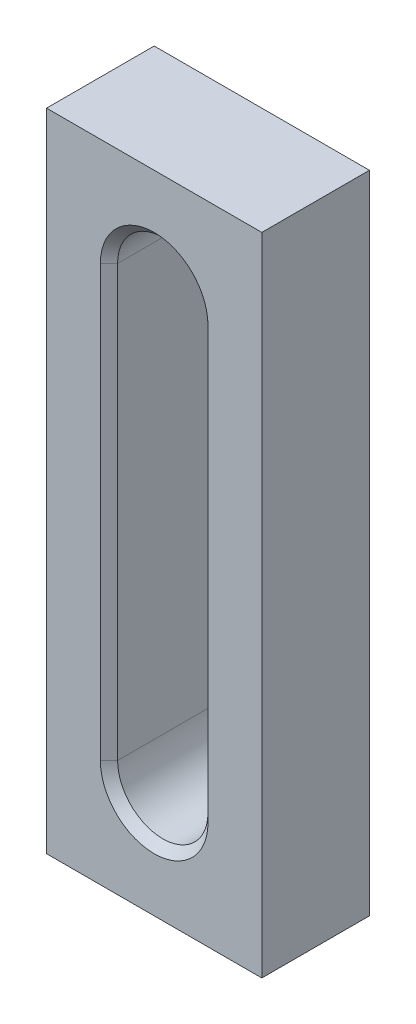
ISO-10303-21;
HEADER;
FILE_DESCRIPTION(('STEP AP214'),'2;1');
FILE_NAME('part.step','',(''),(''),'','','');
FILE_SCHEMA(('AUTOMOTIVE_DESIGN { 1 0 10303 214 1 1 1 1 }'));
ENDSEC;
DATA;
#1=APPLICATION_CONTEXT('core data for automotive mechanical design processes');
#2=APPLICATION_PROTOCOL_DEFINITION('international standard','automotive_design',2000,#1);
#3=PRODUCT_CONTEXT('',#1,'mechanical');
#4=PRODUCT('Part','Part','',(#3));
#5=PRODUCT_RELATED_PRODUCT_CATEGORY('part','',(#4));
#6=PRODUCT_DEFINITION_FORMATION('','',#4);
#7=PRODUCT_DEFINITION_CONTEXT('part definition',#1,'design');
#8=PRODUCT_DEFINITION('design','',#6,#7);
#9=PRODUCT_DEFINITION_SHAPE('','',#8);
#10=(LENGTH_UNIT() NAMED_UNIT(*) SI_UNIT(.MILLI.,.METRE.));
#11=(NAMED_UNIT(*) PLANE_ANGLE_UNIT() SI_UNIT($,.RADIAN.));
#12=(NAMED_UNIT(*) SI_UNIT($,.STERADIAN.) SOLID_ANGLE_UNIT());
#13=UNCERTAINTY_MEASURE_WITH_UNIT(LENGTH_MEASURE(1.E-05),#10,'distance_accuracy_value','');
#14=(GEOMETRIC_REPRESENTATION_CONTEXT(3) GLOBAL_UNCERTAINTY_ASSIGNED_CONTEXT((#13)) GLOBAL_UNIT_ASSIGNED_CONTEXT((#10,
#11,#12)) REPRESENTATION_CONTEXT('',''));
#15=CARTESIAN_POINT('',(0.,0.,0.));
#16=DIRECTION('',(0.,0.,1.));
#17=DIRECTION('',(1.,0.,0.));
#18=AXIS2_PLACEMENT_3D('',#15,#16,#17);
#19=CARTESIAN_POINT('',(0.,0.,25.));
#20=DIRECTION('',(1.,0.,0.));
#21=DIRECTION('',(0.,0.,-1.));
#22=AXIS2_PLACEMENT_3D('',#19,#20,#21);
#23=PLANE('',#22);
#24=DIRECTION('',(0.,-1.,0.));
#25=VECTOR('',#24,1.);
#26=CARTESIAN_POINT('',(0.,0.,0.));
#27=LINE('',#26,#25);
#28=CARTESIAN_POINT('',(0.,150.,0.));
#29=VERTEX_POINT('',#28);
#30=CARTESIAN_POINT('',(0.,0.,0.));
#31=VERTEX_POINT('',#30);
#32=EDGE_CURVE('E148',#29,#31,#27,.T.);
#33=ORIENTED_EDGE('',*,*,#32,.T.);
#34=DIRECTION('',(0.,0.,-1.));
#35=VECTOR('',#34,1.);
#36=CARTESIAN_POINT('',(0.,0.,25.));
#37=LINE('',#36,#35);
#38=CARTESIAN_POINT('',(0.,0.,25.));
#39=VERTEX_POINT('',#38);
#40=EDGE_CURVE('E129',#39,#31,#37,.T.);
#41=ORIENTED_EDGE('',*,*,#40,.F.);
#42=DIRECTION('',(0.,-1.,0.));
#43=VECTOR('',#42,1.);
#44=CARTESIAN_POINT('',(0.,0.,25.));
#45=LINE('',#44,#43);
#46=CARTESIAN_POINT('',(0.,150.,25.));
#47=VERTEX_POINT('',#46);
#48=EDGE_CURVE('E136',#47,#39,#45,.T.);
#49=ORIENTED_EDGE('',*,*,#48,.F.);
#50=DIRECTION('',(0.,0.,-1.));
#51=VECTOR('',#50,1.);
#52=CARTESIAN_POINT('',(0.,150.,25.));
#53=LINE('',#52,#51);
#54=EDGE_CURVE('E237',#47,#29,#53,.T.);
#55=ORIENTED_EDGE('',*,*,#54,.T.);
#56=EDGE_LOOP('',(#33,#41,#49,#55));
#57=FACE_BOUND('',#56,.T.);
#58=ADVANCED_FACE('F34',(#57),#23,.F.);
#59=CARTESIAN_POINT('',(0.,0.,25.));
#60=DIRECTION('',(0.,1.,0.));
#61=DIRECTION('',(0.,0.,1.));
#62=AXIS2_PLACEMENT_3D('',#59,#60,#61);
#63=PLANE('',#62);
#64=DIRECTION('',(1.,0.,0.));
#65=VECTOR('',#64,1.);
#66=CARTESIAN_POINT('',(0.,0.,0.));
#67=LINE('',#66,#65);
#68=CARTESIAN_POINT('',(50.,0.,0.));
#69=VERTEX_POINT('',#68);
#70=EDGE_CURVE('E239',#31,#69,#67,.T.);
#71=ORIENTED_EDGE('',*,*,#70,.T.);
#72=DIRECTION('',(0.,0.,-1.));
#73=VECTOR('',#72,1.);
#74=CARTESIAN_POINT('',(50.,0.,25.));
#75=LINE('',#74,#73);
#76=CARTESIAN_POINT('',(50.,0.,25.));
#77=VERTEX_POINT('',#76);
#78=EDGE_CURVE('E132',#77,#69,#75,.T.);
#79=ORIENTED_EDGE('',*,*,#78,.F.);
#80=DIRECTION('',(1.,0.,0.));
#81=VECTOR('',#80,1.);
#82=CARTESIAN_POINT('',(0.,0.,25.));
#83=LINE('',#82,#81);
#84=EDGE_CURVE('E125',#39,#77,#83,.T.);
#85=ORIENTED_EDGE('',*,*,#84,.F.);
#86=ORIENTED_EDGE('',*,*,#40,.T.);
#87=EDGE_LOOP('',(#71,#79,#85,#86));
#88=FACE_BOUND('',#87,.T.);
#89=ADVANCED_FACE('F127',(#88),#63,.F.);
#90=CARTESIAN_POINT('',(50.,0.,25.));
#91=DIRECTION('',(-1.,0.,0.));
#92=DIRECTION('',(0.,0.,1.));
#93=AXIS2_PLACEMENT_3D('',#90,#91,#92);
#94=PLANE('',#93);
#95=DIRECTION('',(0.,1.,0.));
#96=VECTOR('',#95,1.);
#97=CARTESIAN_POINT('',(50.,0.,0.));
#98=LINE('',#97,#96);
#99=CARTESIAN_POINT('',(50.,150.,0.));
#100=VERTEX_POINT('',#99);
#101=EDGE_CURVE('E241',#69,#100,#98,.T.);
#102=ORIENTED_EDGE('',*,*,#101,.T.);
#103=DIRECTION('',(0.,0.,-1.));
#104=VECTOR('',#103,1.);
#105=CARTESIAN_POINT('',(50.,150.,25.));
#106=LINE('',#105,#104);
#107=CARTESIAN_POINT('',(50.,150.,25.));
#108=VERTEX_POINT('',#107);
#109=EDGE_CURVE('E153',#108,#100,#106,.T.);
#110=ORIENTED_EDGE('',*,*,#109,.F.);
#111=DIRECTION('',(0.,1.,0.));
#112=VECTOR('',#111,1.);
#113=CARTESIAN_POINT('',(50.,0.,25.));
#114=LINE('',#113,#112);
#115=EDGE_CURVE('E135',#77,#108,#114,.T.);
#116=ORIENTED_EDGE('',*,*,#115,.F.);
#117=ORIENTED_EDGE('',*,*,#78,.T.);
#118=EDGE_LOOP('',(#102,#110,#116,#117));
#119=FACE_BOUND('',#118,.T.);
#120=ADVANCED_FACE('F253',(#119),#94,.F.);
#121=CARTESIAN_POINT('',(0.,150.,25.));
#122=DIRECTION('',(0.,-1.,0.));
#123=DIRECTION('',(0.,0.,-1.));
#124=AXIS2_PLACEMENT_3D('',#121,#122,#123);
#125=PLANE('',#124);
#126=DIRECTION('',(-1.,0.,0.));
#127=VECTOR('',#126,1.);
#128=CARTESIAN_POINT('',(0.,150.,0.));
#129=LINE('',#128,#127);
#130=EDGE_CURVE('E145',#100,#29,#129,.T.);
#131=ORIENTED_EDGE('',*,*,#130,.T.);
#132=ORIENTED_EDGE('',*,*,#54,.F.);
#133=DIRECTION('',(-1.,0.,0.));
#134=VECTOR('',#133,1.);
#135=CARTESIAN_POINT('',(0.,150.,25.));
#136=LINE('',#135,#134);
#137=EDGE_CURVE('E141',#108,#47,#136,.T.);
#138=ORIENTED_EDGE('',*,*,#137,.F.);
#139=ORIENTED_EDGE('',*,*,#109,.T.);
#140=EDGE_LOOP('',(#131,#132,#138,#139));
#141=FACE_BOUND('',#140,.T.);
#142=ADVANCED_FACE('F248',(#141),#125,.F.);
#143=CARTESIAN_POINT('',(0.,0.,25.));
#144=DIRECTION('',(0.,0.,-1.));
#145=DIRECTION('',(-1.,0.,0.));
#146=AXIS2_PLACEMENT_3D('',#143,#144,#145);
#147=PLANE('',#146);
#148=CARTESIAN_POINT('',(25.,125.,25.));
#149=DIRECTION('',(0.,0.,-1.));
#150=DIRECTION('',(-1.,0.,0.));
#151=AXIS2_PLACEMENT_3D('',#148,#149,#150);
#152=CIRCLE('',#151,12.5);
#153=CARTESIAN_POINT('',(12.5,125.,25.));
#154=VERTEX_POINT('',#153);
#155=CARTESIAN_POINT('',(37.5,125.,25.));
#156=VERTEX_POINT('',#155);
#157=EDGE_CURVE('E43',#154,#156,#152,.T.);
#158=ORIENTED_EDGE('',*,*,#157,.T.);
#159=DIRECTION('',(0.,-1.,0.));
#160=VECTOR('',#159,1.);
#161=CARTESIAN_POINT('',(37.5,0.,25.));
#162=LINE('',#161,#160);
#163=CARTESIAN_POINT('',(37.5,25.,25.));
#164=VERTEX_POINT('',#163);
#165=EDGE_CURVE('E11',#156,#164,#162,.T.);
#166=ORIENTED_EDGE('',*,*,#165,.T.);
#167=CARTESIAN_POINT('',(25.,25.,25.));
#168=DIRECTION('',(0.,0.,-1.));
#169=DIRECTION('',(-1.,0.,0.));
#170=AXIS2_PLACEMENT_3D('',#167,#168,#169);
#171=CIRCLE('',#170,12.5);
#172=CARTESIAN_POINT('',(12.5,25.,25.));
#173=VERTEX_POINT('',#172);
#174=EDGE_CURVE('E183',#164,#173,#171,.T.);
#175=ORIENTED_EDGE('',*,*,#174,.T.);
#176=DIRECTION('',(0.,1.,0.));
#177=VECTOR('',#176,1.);
#178=CARTESIAN_POINT('',(12.5,0.,25.));
#179=LINE('',#178,#177);
#180=EDGE_CURVE('E181',#173,#154,#179,.T.);
#181=ORIENTED_EDGE('',*,*,#180,.T.);
#182=EDGE_LOOP('',(#158,#166,#175,#181));
#183=FACE_BOUND('',#182,.T.);
#184=ORIENTED_EDGE('',*,*,#48,.T.);
#185=ORIENTED_EDGE('',*,*,#84,.T.);
#186=ORIENTED_EDGE('',*,*,#115,.T.);
#187=ORIENTED_EDGE('',*,*,#137,.T.);
#188=EDGE_LOOP('',(#184,#185,#186,#187));
#189=FACE_BOUND('',#188,.T.);
#190=ADVANCED_FACE('F139',(#183,#189),#147,.F.);
#191=CARTESIAN_POINT('',(0.,0.,0.));
#192=DIRECTION('',(0.,0.,-1.));
#193=DIRECTION('',(-1.,0.,0.));
#194=AXIS2_PLACEMENT_3D('',#191,#192,#193);
#195=PLANE('',#194);
#196=CARTESIAN_POINT('',(25.,125.,0.));
#197=DIRECTION('',(0.,0.,-1.));
#198=DIRECTION('',(-1.,0.,0.));
#199=AXIS2_PLACEMENT_3D('',#196,#197,#198);
#200=CIRCLE('',#199,12.5);
#201=CARTESIAN_POINT('',(37.5,125.,0.));
#202=VERTEX_POINT('',#201);
#203=CARTESIAN_POINT('',(12.5,125.,0.));
#204=VERTEX_POINT('',#203);
#205=EDGE_CURVE('E151',#202,#204,#200,.F.);
#206=ORIENTED_EDGE('',*,*,#205,.T.);
#207=DIRECTION('',(0.,-1.,0.));
#208=VECTOR('',#207,1.);
#209=CARTESIAN_POINT('',(12.5,25.,0.));
#210=LINE('',#209,#208);
#211=CARTESIAN_POINT('',(12.5,25.,0.));
#212=VERTEX_POINT('',#211);
#213=EDGE_CURVE('E160',#204,#212,#210,.T.);
#214=ORIENTED_EDGE('',*,*,#213,.T.);
#215=CARTESIAN_POINT('',(25.,25.,0.));
#216=DIRECTION('',(0.,0.,-1.));
#217=DIRECTION('',(-1.,0.,0.));
#218=AXIS2_PLACEMENT_3D('',#215,#216,#217);
#219=CIRCLE('',#218,12.5);
#220=CARTESIAN_POINT('',(37.5,25.,0.));
#221=VERTEX_POINT('',#220);
#222=EDGE_CURVE('E158',#212,#221,#219,.F.);
#223=ORIENTED_EDGE('',*,*,#222,.T.);
#224=DIRECTION('',(0.,1.,0.));
#225=VECTOR('',#224,1.);
#226=CARTESIAN_POINT('',(37.5,125.,0.));
#227=LINE('',#226,#225);
#228=EDGE_CURVE('E149',#221,#202,#227,.T.);
#229=ORIENTED_EDGE('',*,*,#228,.T.);
#230=EDGE_LOOP('',(#206,#214,#223,#229));
#231=FACE_BOUND('',#230,.T.);
#232=ORIENTED_EDGE('',*,*,#32,.F.);
#233=ORIENTED_EDGE('',*,*,#130,.F.);
#234=ORIENTED_EDGE('',*,*,#101,.F.);
#235=ORIENTED_EDGE('',*,*,#70,.F.);
#236=EDGE_LOOP('',(#232,#233,#234,#235));
#237=FACE_BOUND('',#236,.T.);
#238=ADVANCED_FACE('F252',(#231,#237),#195,.T.);
#239=CARTESIAN_POINT('',(25.,25.,0.));
#240=DIRECTION('',(0.,0.,1.));
#241=DIRECTION('',(1.,0.,0.));
#242=AXIS2_PLACEMENT_3D('',#239,#240,#241);
#243=CYLINDRICAL_SURFACE('',#242,10.5);
#244=DIRECTION('',(0.,0.,1.));
#245=VECTOR('',#244,1.);
#246=CARTESIAN_POINT('',(35.5,25.,0.));
#247=LINE('',#246,#245);
#248=CARTESIAN_POINT('',(35.5,25.,2.));
#249=VERTEX_POINT('',#248);
#250=CARTESIAN_POINT('',(35.5,25.,23.));
#251=VERTEX_POINT('',#250);
#252=EDGE_CURVE('E196',#249,#251,#247,.T.);
#253=ORIENTED_EDGE('',*,*,#252,.F.);
#254=CARTESIAN_POINT('',(25.,25.,2.));
#255=DIRECTION('',(0.,0.,-1.));
#256=DIRECTION('',(-1.,0.,0.));
#257=AXIS2_PLACEMENT_3D('',#254,#255,#256);
#258=CIRCLE('',#257,10.5);
#259=CARTESIAN_POINT('',(14.5,25.,2.));
#260=VERTEX_POINT('',#259);
#261=EDGE_CURVE('E170',#249,#260,#258,.T.);
#262=ORIENTED_EDGE('',*,*,#261,.T.);
#263=DIRECTION('',(0.,0.,1.));
#264=VECTOR('',#263,1.);
#265=CARTESIAN_POINT('',(14.5,25.,0.));
#266=LINE('',#265,#264);
#267=CARTESIAN_POINT('',(14.5,25.,23.));
#268=VERTEX_POINT('',#267);
#269=EDGE_CURVE('E230',#260,#268,#266,.T.);
#270=ORIENTED_EDGE('',*,*,#269,.T.);
#271=CARTESIAN_POINT('',(25.,25.,23.));
#272=DIRECTION('',(0.,0.,-1.));
#273=DIRECTION('',(-1.,0.,0.));
#274=AXIS2_PLACEMENT_3D('',#271,#272,#273);
#275=CIRCLE('',#274,10.5);
#276=EDGE_CURVE('E168',#268,#251,#275,.F.);
#277=ORIENTED_EDGE('',*,*,#276,.T.);
#278=EDGE_LOOP('',(#253,#262,#270,#277));
#279=FACE_BOUND('',#278,.T.);
#280=ADVANCED_FACE('F327',(#279),#243,.F.);
#281=CARTESIAN_POINT('',(14.5,125.,0.));
#282=DIRECTION('',(-1.,0.,0.));
#283=DIRECTION('',(0.,0.,1.));
#284=AXIS2_PLACEMENT_3D('',#281,#282,#283);
#285=PLANE('',#284);
#286=ORIENTED_EDGE('',*,*,#269,.F.);
#287=DIRECTION('',(0.,1.,0.));
#288=VECTOR('',#287,1.);
#289=CARTESIAN_POINT('',(14.5,125.,2.));
#290=LINE('',#289,#288);
#291=CARTESIAN_POINT('',(14.5,125.,2.));
#292=VERTEX_POINT('',#291);
#293=EDGE_CURVE('E165',#260,#292,#290,.T.);
#294=ORIENTED_EDGE('',*,*,#293,.T.);
#295=DIRECTION('',(0.,0.,1.));
#296=VECTOR('',#295,1.);
#297=CARTESIAN_POINT('',(14.5,125.,0.));
#298=LINE('',#297,#296);
#299=CARTESIAN_POINT('',(14.5,125.,23.));
#300=VERTEX_POINT('',#299);
#301=EDGE_CURVE('E228',#292,#300,#298,.T.);
#302=ORIENTED_EDGE('',*,*,#301,.T.);
#303=DIRECTION('',(0.,-1.,0.));
#304=VECTOR('',#303,1.);
#305=CARTESIAN_POINT('',(14.5,125.,23.));
#306=LINE('',#305,#304);
#307=EDGE_CURVE('E163',#300,#268,#306,.T.);
#308=ORIENTED_EDGE('',*,*,#307,.T.);
#309=EDGE_LOOP('',(#286,#294,#302,#308));
#310=FACE_BOUND('',#309,.T.);
#311=ADVANCED_FACE('F320',(#310),#285,.F.);
#312=CARTESIAN_POINT('',(25.,125.,0.));
#313=DIRECTION('',(0.,0.,1.));
#314=DIRECTION('',(1.,0.,0.));
#315=AXIS2_PLACEMENT_3D('',#312,#313,#314);
#316=CYLINDRICAL_SURFACE('',#315,10.5);
#317=ORIENTED_EDGE('',*,*,#301,.F.);
#318=CARTESIAN_POINT('',(25.,125.,2.));
#319=DIRECTION('',(0.,0.,-1.));
#320=DIRECTION('',(-1.,0.,0.));
#321=AXIS2_PLACEMENT_3D('',#318,#319,#320);
#322=CIRCLE('',#321,10.5);
#323=CARTESIAN_POINT('',(35.5,125.,2.));
#324=VERTEX_POINT('',#323);
#325=EDGE_CURVE('E174',#292,#324,#322,.T.);
#326=ORIENTED_EDGE('',*,*,#325,.T.);
#327=DIRECTION('',(0.,0.,1.));
#328=VECTOR('',#327,1.);
#329=CARTESIAN_POINT('',(35.5,125.,0.));
#330=LINE('',#329,#328);
#331=CARTESIAN_POINT('',(35.5,125.,23.));
#332=VERTEX_POINT('',#331);
#333=EDGE_CURVE('E223',#324,#332,#330,.T.);
#334=ORIENTED_EDGE('',*,*,#333,.T.);
#335=CARTESIAN_POINT('',(25.,125.,23.));
#336=DIRECTION('',(0.,0.,-1.));
#337=DIRECTION('',(-1.,0.,0.));
#338=AXIS2_PLACEMENT_3D('',#335,#336,#337);
#339=CIRCLE('',#338,10.5);
#340=EDGE_CURVE('E172',#332,#300,#339,.F.);
#341=ORIENTED_EDGE('',*,*,#340,.T.);
#342=EDGE_LOOP('',(#317,#326,#334,#341));
#343=FACE_BOUND('',#342,.T.);
#344=ADVANCED_FACE('F226',(#343),#316,.F.);
#345=CARTESIAN_POINT('',(35.5,125.,0.));
#346=DIRECTION('',(1.,0.,0.));
#347=DIRECTION('',(0.,0.,-1.));
#348=AXIS2_PLACEMENT_3D('',#345,#346,#347);
#349=PLANE('',#348);
#350=ORIENTED_EDGE('',*,*,#333,.F.);
#351=DIRECTION('',(0.,-1.,0.));
#352=VECTOR('',#351,1.);
#353=CARTESIAN_POINT('',(35.5,25.,2.));
#354=LINE('',#353,#352);
#355=EDGE_CURVE('E179',#324,#249,#354,.T.);
#356=ORIENTED_EDGE('',*,*,#355,.T.);
#357=ORIENTED_EDGE('',*,*,#252,.T.);
#358=DIRECTION('',(0.,1.,0.));
#359=VECTOR('',#358,1.);
#360=CARTESIAN_POINT('',(35.5,125.,23.));
#361=LINE('',#360,#359);
#362=EDGE_CURVE('E176',#251,#332,#361,.T.);
#363=ORIENTED_EDGE('',*,*,#362,.T.);
#364=EDGE_LOOP('',(#350,#356,#357,#363));
#365=FACE_BOUND('',#364,.T.);
#366=ADVANCED_FACE('F222',(#365),#349,.F.);
#367=CARTESIAN_POINT('',(37.5,0.,0.));
#368=DIRECTION('',(-0.70710678118655,0.,-0.707106781186545));
#369=DIRECTION('',(0.,-1.,0.));
#370=AXIS2_PLACEMENT_3D('',#367,#368,#369);
#371=PLANE('',#370);
#372=DIRECTION('',(0.707106781186545,0.,-0.70710678118655));
#373=VECTOR('',#372,1.);
#374=CARTESIAN_POINT('',(35.5,25.,2.));
#375=LINE('',#374,#373);
#376=EDGE_CURVE('E190',#249,#221,#375,.T.);
#377=ORIENTED_EDGE('',*,*,#376,.F.);
#378=ORIENTED_EDGE('',*,*,#355,.F.);
#379=DIRECTION('',(-0.707106781186545,0.,0.70710678118655));
#380=VECTOR('',#379,1.);
#381=CARTESIAN_POINT('',(37.5,125.,0.));
#382=LINE('',#381,#380);
#383=EDGE_CURVE('E193',#202,#324,#382,.T.);
#384=ORIENTED_EDGE('',*,*,#383,.F.);
#385=ORIENTED_EDGE('',*,*,#228,.F.);
#386=EDGE_LOOP('',(#377,#378,#384,#385));
#387=FACE_BOUND('',#386,.T.);
#388=ADVANCED_FACE('F278',(#387),#371,.T.);
#389=CARTESIAN_POINT('',(25.,125.,0.));
#390=DIRECTION('',(0.,0.,-1.));
#391=DIRECTION('',(-1.,0.,0.));
#392=AXIS2_PLACEMENT_3D('',#389,#390,#391);
#393=CONICAL_SURFACE('',#392,12.5,0.785398163397445);
#394=ORIENTED_EDGE('',*,*,#383,.T.);
#395=ORIENTED_EDGE('',*,*,#325,.F.);
#396=DIRECTION('',(0.707106781186545,0.,0.70710678118655));
#397=VECTOR('',#396,1.);
#398=CARTESIAN_POINT('',(12.5,125.,0.));
#399=LINE('',#398,#397);
#400=EDGE_CURVE('E188',#204,#292,#399,.T.);
#401=ORIENTED_EDGE('',*,*,#400,.F.);
#402=ORIENTED_EDGE('',*,*,#205,.F.);
#403=EDGE_LOOP('',(#394,#395,#401,#402));
#404=FACE_BOUND('',#403,.T.);
#405=ADVANCED_FACE('F274',(#404),#393,.F.);
#406=CARTESIAN_POINT('',(25.,25.,0.));
#407=DIRECTION('',(0.,0.,-1.));
#408=DIRECTION('',(-1.,0.,0.));
#409=AXIS2_PLACEMENT_3D('',#406,#407,#408);
#410=CONICAL_SURFACE('',#409,12.5,0.785398163397445);
#411=ORIENTED_EDGE('',*,*,#376,.T.);
#412=ORIENTED_EDGE('',*,*,#222,.F.);
#413=DIRECTION('',(-0.707106781186545,0.,-0.70710678118655));
#414=VECTOR('',#413,1.);
#415=CARTESIAN_POINT('',(14.5,25.,2.));
#416=LINE('',#415,#414);
#417=EDGE_CURVE('E186',#260,#212,#416,.T.);
#418=ORIENTED_EDGE('',*,*,#417,.F.);
#419=ORIENTED_EDGE('',*,*,#261,.F.);
#420=EDGE_LOOP('',(#411,#412,#418,#419));
#421=FACE_BOUND('',#420,.T.);
#422=ADVANCED_FACE('F270',(#421),#410,.F.);
#423=CARTESIAN_POINT('',(12.5,0.,0.));
#424=DIRECTION('',(0.70710678118655,0.,-0.707106781186545));
#425=DIRECTION('',(0.,1.,0.));
#426=AXIS2_PLACEMENT_3D('',#423,#424,#425);
#427=PLANE('',#426);
#428=ORIENTED_EDGE('',*,*,#400,.T.);
#429=ORIENTED_EDGE('',*,*,#293,.F.);
#430=ORIENTED_EDGE('',*,*,#417,.T.);
#431=ORIENTED_EDGE('',*,*,#213,.F.);
#432=EDGE_LOOP('',(#428,#429,#430,#431));
#433=FACE_BOUND('',#432,.T.);
#434=ADVANCED_FACE('F267',(#433),#427,.T.);
#435=CARTESIAN_POINT('',(14.5,125.,23.));
#436=DIRECTION('',(-0.707106781186545,0.,-0.70710678118655));
#437=DIRECTION('',(0.,-1.,0.));
#438=AXIS2_PLACEMENT_3D('',#435,#436,#437);
#439=PLANE('',#438);
#440=DIRECTION('',(0.70710678118655,0.,-0.707106781186545));
#441=VECTOR('',#440,1.);
#442=CARTESIAN_POINT('',(12.5,125.,25.));
#443=LINE('',#442,#441);
#444=EDGE_CURVE('E199',#154,#300,#443,.T.);
#445=ORIENTED_EDGE('',*,*,#444,.F.);
#446=ORIENTED_EDGE('',*,*,#180,.F.);
#447=DIRECTION('',(-0.70710678118655,0.,0.707106781186545));
#448=VECTOR('',#447,1.);
#449=CARTESIAN_POINT('',(14.5,25.,23.));
#450=LINE('',#449,#448);
#451=EDGE_CURVE('E38',#268,#173,#450,.T.);
#452=ORIENTED_EDGE('',*,*,#451,.F.);
#453=ORIENTED_EDGE('',*,*,#307,.F.);
#454=EDGE_LOOP('',(#445,#446,#452,#453));
#455=FACE_BOUND('',#454,.T.);
#456=ADVANCED_FACE('F36',(#455),#439,.F.);
#457=CARTESIAN_POINT('',(25.,25.,23.));
#458=DIRECTION('',(0.,0.,1.));
#459=DIRECTION('',(1.,0.,0.));
#460=AXIS2_PLACEMENT_3D('',#457,#458,#459);
#461=CONICAL_SURFACE('',#460,10.5,0.785398163397452);
#462=ORIENTED_EDGE('',*,*,#451,.T.);
#463=ORIENTED_EDGE('',*,*,#174,.F.);
#464=DIRECTION('',(0.70710678118655,0.,0.707106781186545));
#465=VECTOR('',#464,1.);
#466=CARTESIAN_POINT('',(35.5,25.,23.));
#467=LINE('',#466,#465);
#468=EDGE_CURVE('E56',#251,#164,#467,.T.);
#469=ORIENTED_EDGE('',*,*,#468,.F.);
#470=ORIENTED_EDGE('',*,*,#276,.F.);
#471=EDGE_LOOP('',(#462,#463,#469,#470));
#472=FACE_BOUND('',#471,.T.);
#473=ADVANCED_FACE('F208',(#472),#461,.F.);
#474=CARTESIAN_POINT('',(25.,125.,23.));
#475=DIRECTION('',(0.,0.,1.));
#476=DIRECTION('',(1.,0.,0.));
#477=AXIS2_PLACEMENT_3D('',#474,#475,#476);
#478=CONICAL_SURFACE('',#477,10.5,0.785398163397452);
#479=ORIENTED_EDGE('',*,*,#444,.T.);
#480=ORIENTED_EDGE('',*,*,#340,.F.);
#481=DIRECTION('',(-0.70710678118655,0.,-0.707106781186545));
#482=VECTOR('',#481,1.);
#483=CARTESIAN_POINT('',(37.5,125.,25.));
#484=LINE('',#483,#482);
#485=EDGE_CURVE('E197',#156,#332,#484,.T.);
#486=ORIENTED_EDGE('',*,*,#485,.F.);
#487=ORIENTED_EDGE('',*,*,#157,.F.);
#488=EDGE_LOOP('',(#479,#480,#486,#487));
#489=FACE_BOUND('',#488,.T.);
#490=ADVANCED_FACE('F214',(#489),#478,.F.);
#491=CARTESIAN_POINT('',(35.5,125.,23.));
#492=DIRECTION('',(0.707106781186545,0.,-0.70710678118655));
#493=DIRECTION('',(0.,1.,0.));
#494=AXIS2_PLACEMENT_3D('',#491,#492,#493);
#495=PLANE('',#494);
#496=ORIENTED_EDGE('',*,*,#468,.T.);
#497=ORIENTED_EDGE('',*,*,#165,.F.);
#498=ORIENTED_EDGE('',*,*,#485,.T.);
#499=ORIENTED_EDGE('',*,*,#362,.F.);
#500=EDGE_LOOP('',(#496,#497,#498,#499));
#501=FACE_BOUND('',#500,.T.);
#502=ADVANCED_FACE('F213',(#501),#495,.F.);
#503=CLOSED_SHELL('',(#58,#89,#120,#142,#190,#238,#280,#311,#344,#366,#388,#405,#422,#434,#456,
#473,#490,#502));
#504=MANIFOLD_SOLID_BREP('B2',#503);
#505=ADVANCED_BREP_SHAPE_REPRESENTATION('',(#18,#504),#14);
#506=SHAPE_DEFINITION_REPRESENTATION(#9,#505);
ENDSEC;
END-ISO-10303-21;
